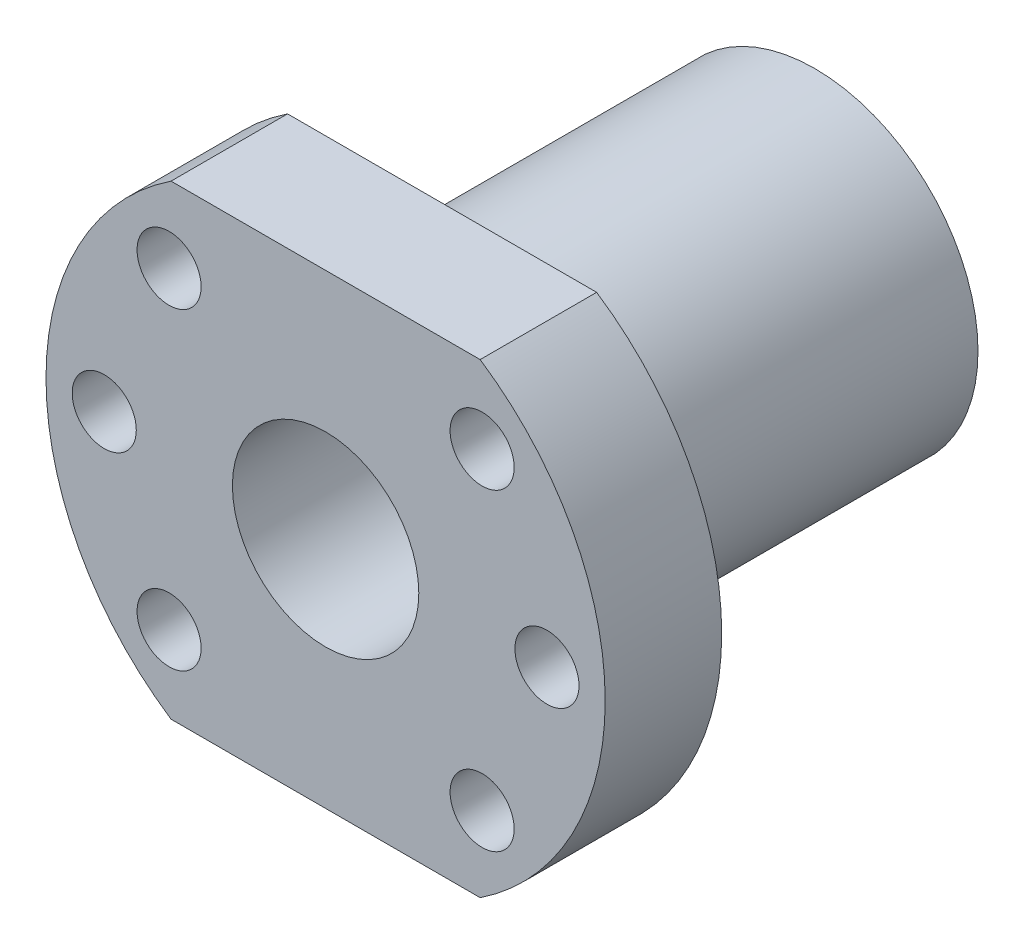
ISO-10303-21;
HEADER;
FILE_DESCRIPTION(('STEP AP214'),'2;1');
FILE_NAME('part.step','',(''),(''),'','','');
FILE_SCHEMA(('AUTOMOTIVE_DESIGN { 1 0 10303 214 1 1 1 1 }'));
ENDSEC;
DATA;
#1=APPLICATION_CONTEXT('core data for automotive mechanical design processes');
#2=APPLICATION_PROTOCOL_DEFINITION('international standard','automotive_design',2000,#1);
#3=PRODUCT_CONTEXT('',#1,'mechanical');
#4=PRODUCT('Part','Part','',(#3));
#5=PRODUCT_RELATED_PRODUCT_CATEGORY('part','',(#4));
#6=PRODUCT_DEFINITION_FORMATION('','',#4);
#7=PRODUCT_DEFINITION_CONTEXT('part definition',#1,'design');
#8=PRODUCT_DEFINITION('design','',#6,#7);
#9=PRODUCT_DEFINITION_SHAPE('','',#8);
#10=(LENGTH_UNIT() NAMED_UNIT(*) SI_UNIT(.MILLI.,.METRE.));
#11=(NAMED_UNIT(*) PLANE_ANGLE_UNIT() SI_UNIT($,.RADIAN.));
#12=(NAMED_UNIT(*) SI_UNIT($,.STERADIAN.) SOLID_ANGLE_UNIT());
#13=UNCERTAINTY_MEASURE_WITH_UNIT(LENGTH_MEASURE(1.E-05),#10,'distance_accuracy_value','');
#14=(GEOMETRIC_REPRESENTATION_CONTEXT(3) GLOBAL_UNCERTAINTY_ASSIGNED_CONTEXT((#13)) GLOBAL_UNIT_ASSIGNED_CONTEXT((#10,
#11,#12)) REPRESENTATION_CONTEXT('',''));
#15=CARTESIAN_POINT('',(0.,0.,0.));
#16=DIRECTION('',(0.,0.,1.));
#17=DIRECTION('',(1.,0.,0.));
#18=AXIS2_PLACEMENT_3D('',#15,#16,#17);
#19=CARTESIAN_POINT('',(0.,0.,-42.));
#20=DIRECTION('',(0.,0.,1.));
#21=DIRECTION('',(1.,0.,0.));
#22=AXIS2_PLACEMENT_3D('',#19,#20,#21);
#23=CYLINDRICAL_SURFACE('',#22,14.);
#24=CARTESIAN_POINT('',(0.,0.,-42.));
#25=DIRECTION('',(0.,0.,1.));
#26=DIRECTION('',(1.,0.,0.));
#27=AXIS2_PLACEMENT_3D('',#24,#25,#26);
#28=CIRCLE('',#27,14.);
#29=CARTESIAN_POINT('',(14.,0.,-42.));
#30=VERTEX_POINT('',#29);
#31=EDGE_CURVE('E11',#30,#30,#28,.T.);
#32=ORIENTED_EDGE('',*,*,#31,.T.);
#33=EDGE_LOOP('',(#32));
#34=FACE_BOUND('',#33,.T.);
#35=CARTESIAN_POINT('',(0.,0.,-10.));
#36=DIRECTION('',(0.,0.,1.));
#37=DIRECTION('',(1.,0.,0.));
#38=AXIS2_PLACEMENT_3D('',#35,#36,#37);
#39=CIRCLE('',#38,14.);
#40=CARTESIAN_POINT('',(14.,0.,-10.));
#41=VERTEX_POINT('',#40);
#42=EDGE_CURVE('E105',#41,#41,#39,.F.);
#43=ORIENTED_EDGE('',*,*,#42,.T.);
#44=EDGE_LOOP('',(#43));
#45=FACE_BOUND('',#44,.T.);
#46=ADVANCED_FACE('F34',(#34,#45),#23,.T.);
#47=CARTESIAN_POINT('',(0.,0.,-42.));
#48=DIRECTION('',(0.,0.,1.));
#49=DIRECTION('',(1.,0.,0.));
#50=AXIS2_PLACEMENT_3D('',#47,#48,#49);
#51=PLANE('',#50);
#52=CARTESIAN_POINT('',(0.,0.,-42.));
#53=DIRECTION('',(0.,0.,1.));
#54=DIRECTION('',(1.,0.,0.));
#55=AXIS2_PLACEMENT_3D('',#52,#53,#54);
#56=CIRCLE('',#55,8.);
#57=CARTESIAN_POINT('',(8.,0.,-42.));
#58=VERTEX_POINT('',#57);
#59=EDGE_CURVE('E43',#58,#58,#56,.T.);
#60=ORIENTED_EDGE('',*,*,#59,.T.);
#61=EDGE_LOOP('',(#60));
#62=FACE_BOUND('',#61,.T.);
#63=ORIENTED_EDGE('',*,*,#31,.F.);
#64=EDGE_LOOP('',(#63));
#65=FACE_BOUND('',#64,.T.);
#66=ADVANCED_FACE('F173',(#62,#65),#51,.F.);
#67=CARTESIAN_POINT('',(0.,0.,0.));
#68=DIRECTION('',(0.,0.,1.));
#69=DIRECTION('',(1.,0.,0.));
#70=AXIS2_PLACEMENT_3D('',#67,#68,#69);
#71=PLANE('',#70);
#72=CARTESIAN_POINT('',(-13.4350288425445,13.4350288425443,0.));
#73=DIRECTION('',(0.,0.,1.));
#74=DIRECTION('',(1.,0.,0.));
#75=AXIS2_PLACEMENT_3D('',#72,#73,#74);
#76=CIRCLE('',#75,2.74999999999999);
#77=CARTESIAN_POINT('',(-10.6850288425445,13.4350288425443,0.));
#78=VERTEX_POINT('',#77);
#79=EDGE_CURVE('E137',#78,#78,#76,.T.);
#80=ORIENTED_EDGE('',*,*,#79,.F.);
#81=EDGE_LOOP('',(#80));
#82=FACE_BOUND('',#81,.T.);
#83=CARTESIAN_POINT('',(13.4350288425445,-13.4350288425443,0.));
#84=DIRECTION('',(0.,0.,1.));
#85=DIRECTION('',(1.,0.,0.));
#86=AXIS2_PLACEMENT_3D('',#83,#84,#85);
#87=CIRCLE('',#86,2.74999999999999);
#88=CARTESIAN_POINT('',(16.1850288425445,-13.4350288425443,0.));
#89=VERTEX_POINT('',#88);
#90=EDGE_CURVE('E127',#89,#89,#87,.T.);
#91=ORIENTED_EDGE('',*,*,#90,.F.);
#92=EDGE_LOOP('',(#91));
#93=FACE_BOUND('',#92,.T.);
#94=CARTESIAN_POINT('',(13.4350288425444,13.4350288425444,0.));
#95=DIRECTION('',(0.,0.,1.));
#96=DIRECTION('',(1.,0.,0.));
#97=AXIS2_PLACEMENT_3D('',#94,#95,#96);
#98=CIRCLE('',#97,2.74999999999999);
#99=CARTESIAN_POINT('',(16.1850288425444,13.4350288425444,0.));
#100=VERTEX_POINT('',#99);
#101=EDGE_CURVE('E124',#100,#100,#98,.T.);
#102=ORIENTED_EDGE('',*,*,#101,.F.);
#103=EDGE_LOOP('',(#102));
#104=FACE_BOUND('',#103,.T.);
#105=CARTESIAN_POINT('',(-13.4350288425444,-13.4350288425444,0.));
#106=DIRECTION('',(0.,0.,1.));
#107=DIRECTION('',(1.,0.,0.));
#108=AXIS2_PLACEMENT_3D('',#105,#106,#107);
#109=CIRCLE('',#108,2.74999999999999);
#110=CARTESIAN_POINT('',(-10.6850288425444,-13.4350288425444,0.));
#111=VERTEX_POINT('',#110);
#112=EDGE_CURVE('E121',#111,#111,#109,.T.);
#113=ORIENTED_EDGE('',*,*,#112,.F.);
#114=EDGE_LOOP('',(#113));
#115=FACE_BOUND('',#114,.T.);
#116=CARTESIAN_POINT('',(19.,0.,0.));
#117=DIRECTION('',(0.,0.,1.));
#118=DIRECTION('',(1.,0.,0.));
#119=AXIS2_PLACEMENT_3D('',#116,#117,#118);
#120=CIRCLE('',#119,2.74999999999999);
#121=CARTESIAN_POINT('',(21.75,0.,0.));
#122=VERTEX_POINT('',#121);
#123=EDGE_CURVE('E117',#122,#122,#120,.T.);
#124=ORIENTED_EDGE('',*,*,#123,.F.);
#125=EDGE_LOOP('',(#124));
#126=FACE_BOUND('',#125,.T.);
#127=CARTESIAN_POINT('',(-19.,0.,0.));
#128=DIRECTION('',(0.,0.,1.));
#129=DIRECTION('',(1.,0.,0.));
#130=AXIS2_PLACEMENT_3D('',#127,#128,#129);
#131=CIRCLE('',#130,2.74999999999999);
#132=CARTESIAN_POINT('',(-16.25,0.,0.));
#133=VERTEX_POINT('',#132);
#134=EDGE_CURVE('E116',#133,#133,#131,.T.);
#135=ORIENTED_EDGE('',*,*,#134,.F.);
#136=EDGE_LOOP('',(#135));
#137=FACE_BOUND('',#136,.T.);
#138=CARTESIAN_POINT('',(0.,0.,0.));
#139=DIRECTION('',(0.,0.,1.));
#140=DIRECTION('',(1.,0.,0.));
#141=AXIS2_PLACEMENT_3D('',#138,#139,#140);
#142=CIRCLE('',#141,8.);
#143=CARTESIAN_POINT('',(8.,0.,0.));
#144=VERTEX_POINT('',#143);
#145=EDGE_CURVE('E108',#144,#144,#142,.T.);
#146=ORIENTED_EDGE('',*,*,#145,.F.);
#147=EDGE_LOOP('',(#146));
#148=FACE_BOUND('',#147,.T.);
#149=DIRECTION('',(1.,0.,0.));
#150=VECTOR('',#149,1.);
#151=CARTESIAN_POINT('',(0.,20.,0.));
#152=LINE('',#151,#150);
#153=CARTESIAN_POINT('',(-13.2664991614216,20.,0.));
#154=VERTEX_POINT('',#153);
#155=CARTESIAN_POINT('',(13.2664991614216,20.,0.));
#156=VERTEX_POINT('',#155);
#157=EDGE_CURVE('E148',#154,#156,#152,.T.);
#158=ORIENTED_EDGE('',*,*,#157,.F.);
#159=CARTESIAN_POINT('',(0.,0.,0.));
#160=DIRECTION('',(0.,0.,1.));
#161=DIRECTION('',(1.,0.,0.));
#162=AXIS2_PLACEMENT_3D('',#159,#160,#161);
#163=CIRCLE('',#162,24.);
#164=CARTESIAN_POINT('',(-13.2664991614216,-20.,0.));
#165=VERTEX_POINT('',#164);
#166=EDGE_CURVE('E151',#154,#165,#163,.T.);
#167=ORIENTED_EDGE('',*,*,#166,.T.);
#168=DIRECTION('',(1.,0.,0.));
#169=VECTOR('',#168,1.);
#170=CARTESIAN_POINT('',(0.,-20.,0.));
#171=LINE('',#170,#169);
#172=CARTESIAN_POINT('',(13.2664991614216,-20.,0.));
#173=VERTEX_POINT('',#172);
#174=EDGE_CURVE('E89',#165,#173,#171,.T.);
#175=ORIENTED_EDGE('',*,*,#174,.T.);
#176=EDGE_CURVE('E98',#173,#156,#163,.T.);
#177=ORIENTED_EDGE('',*,*,#176,.T.);
#178=EDGE_LOOP('',(#158,#167,#175,#177));
#179=FACE_BOUND('',#178,.T.);
#180=ADVANCED_FACE('F158',(#82,#93,#104,#115,#126,#137,#148,#179),#71,.T.);
#181=CARTESIAN_POINT('',(0.,0.,-42.));
#182=DIRECTION('',(0.,0.,1.));
#183=DIRECTION('',(1.,0.,0.));
#184=AXIS2_PLACEMENT_3D('',#181,#182,#183);
#185=CYLINDRICAL_SURFACE('',#184,8.);
#186=ORIENTED_EDGE('',*,*,#145,.T.);
#187=EDGE_LOOP('',(#186));
#188=FACE_BOUND('',#187,.T.);
#189=ORIENTED_EDGE('',*,*,#59,.F.);
#190=EDGE_LOOP('',(#189));
#191=FACE_BOUND('',#190,.T.);
#192=ADVANCED_FACE('F168',(#188,#191),#185,.F.);
#193=CARTESIAN_POINT('',(0.,20.,-10.));
#194=DIRECTION('',(0.,-1.,0.));
#195=DIRECTION('',(0.,0.,-1.));
#196=AXIS2_PLACEMENT_3D('',#193,#194,#195);
#197=PLANE('',#196);
#198=ORIENTED_EDGE('',*,*,#157,.T.);
#199=DIRECTION('',(0.,0.,1.));
#200=VECTOR('',#199,1.);
#201=CARTESIAN_POINT('',(13.2664991614216,20.,-10.));
#202=LINE('',#201,#200);
#203=CARTESIAN_POINT('',(13.2664991614216,20.,-10.));
#204=VERTEX_POINT('',#203);
#205=EDGE_CURVE('E76',#204,#156,#202,.T.);
#206=ORIENTED_EDGE('',*,*,#205,.F.);
#207=DIRECTION('',(1.,0.,0.));
#208=VECTOR('',#207,1.);
#209=CARTESIAN_POINT('',(0.,20.,-10.));
#210=LINE('',#209,#208);
#211=CARTESIAN_POINT('',(-13.2664991614216,20.,-10.));
#212=VERTEX_POINT('',#211);
#213=EDGE_CURVE('E52',#212,#204,#210,.T.);
#214=ORIENTED_EDGE('',*,*,#213,.F.);
#215=DIRECTION('',(0.,0.,1.));
#216=VECTOR('',#215,1.);
#217=CARTESIAN_POINT('',(-13.2664991614216,20.,-10.));
#218=LINE('',#217,#216);
#219=EDGE_CURVE('E83',#212,#154,#218,.T.);
#220=ORIENTED_EDGE('',*,*,#219,.T.);
#221=EDGE_LOOP('',(#198,#206,#214,#220));
#222=FACE_BOUND('',#221,.T.);
#223=ADVANCED_FACE('F161',(#222),#197,.F.);
#224=CARTESIAN_POINT('',(0.,0.,-10.));
#225=DIRECTION('',(0.,0.,1.));
#226=DIRECTION('',(1.,0.,0.));
#227=AXIS2_PLACEMENT_3D('',#224,#225,#226);
#228=CYLINDRICAL_SURFACE('',#227,24.);
#229=ORIENTED_EDGE('',*,*,#176,.F.);
#230=DIRECTION('',(0.,0.,1.));
#231=VECTOR('',#230,1.);
#232=CARTESIAN_POINT('',(13.2664991614216,-20.,-10.));
#233=LINE('',#232,#231);
#234=CARTESIAN_POINT('',(13.2664991614216,-20.,-10.));
#235=VERTEX_POINT('',#234);
#236=EDGE_CURVE('E69',#235,#173,#233,.T.);
#237=ORIENTED_EDGE('',*,*,#236,.F.);
#238=CARTESIAN_POINT('',(0.,0.,-10.));
#239=DIRECTION('',(0.,0.,1.));
#240=DIRECTION('',(1.,0.,0.));
#241=AXIS2_PLACEMENT_3D('',#238,#239,#240);
#242=CIRCLE('',#241,24.);
#243=EDGE_CURVE('E94',#235,#204,#242,.T.);
#244=ORIENTED_EDGE('',*,*,#243,.T.);
#245=ORIENTED_EDGE('',*,*,#205,.T.);
#246=EDGE_LOOP('',(#229,#237,#244,#245));
#247=FACE_BOUND('',#246,.T.);
#248=ADVANCED_FACE('F159',(#247),#228,.T.);
#249=CARTESIAN_POINT('',(0.,-20.,-10.));
#250=DIRECTION('',(0.,-1.,0.));
#251=DIRECTION('',(0.,0.,-1.));
#252=AXIS2_PLACEMENT_3D('',#249,#250,#251);
#253=PLANE('',#252);
#254=ORIENTED_EDGE('',*,*,#174,.F.);
#255=DIRECTION('',(0.,0.,1.));
#256=VECTOR('',#255,1.);
#257=CARTESIAN_POINT('',(-13.2664991614216,-20.,-10.));
#258=LINE('',#257,#256);
#259=CARTESIAN_POINT('',(-13.2664991614216,-20.,-10.));
#260=VERTEX_POINT('',#259);
#261=EDGE_CURVE('E85',#260,#165,#258,.T.);
#262=ORIENTED_EDGE('',*,*,#261,.F.);
#263=DIRECTION('',(1.,0.,0.));
#264=VECTOR('',#263,1.);
#265=CARTESIAN_POINT('',(0.,-20.,-10.));
#266=LINE('',#265,#264);
#267=EDGE_CURVE('E88',#260,#235,#266,.T.);
#268=ORIENTED_EDGE('',*,*,#267,.T.);
#269=ORIENTED_EDGE('',*,*,#236,.T.);
#270=EDGE_LOOP('',(#254,#262,#268,#269));
#271=FACE_BOUND('',#270,.T.);
#272=ADVANCED_FACE('F87',(#271),#253,.T.);
#273=ORIENTED_EDGE('',*,*,#166,.F.);
#274=ORIENTED_EDGE('',*,*,#219,.F.);
#275=EDGE_CURVE('E93',#212,#260,#242,.T.);
#276=ORIENTED_EDGE('',*,*,#275,.T.);
#277=ORIENTED_EDGE('',*,*,#261,.T.);
#278=EDGE_LOOP('',(#273,#274,#276,#277));
#279=FACE_BOUND('',#278,.T.);
#280=ADVANCED_FACE('F96',(#279),#228,.T.);
#281=CARTESIAN_POINT('',(0.,0.,-10.));
#282=DIRECTION('',(0.,0.,1.));
#283=DIRECTION('',(1.,0.,0.));
#284=AXIS2_PLACEMENT_3D('',#281,#282,#283);
#285=PLANE('',#284);
#286=CARTESIAN_POINT('',(-13.4350288425445,13.4350288425443,-10.));
#287=DIRECTION('',(0.,0.,1.));
#288=DIRECTION('',(1.,0.,0.));
#289=AXIS2_PLACEMENT_3D('',#286,#287,#288);
#290=CIRCLE('',#289,2.74999999999999);
#291=CARTESIAN_POINT('',(-10.6850288425445,13.4350288425443,-10.));
#292=VERTEX_POINT('',#291);
#293=EDGE_CURVE('E37',#292,#292,#290,.T.);
#294=ORIENTED_EDGE('',*,*,#293,.T.);
#295=EDGE_LOOP('',(#294));
#296=FACE_BOUND('',#295,.T.);
#297=CARTESIAN_POINT('',(13.4350288425445,-13.4350288425443,-10.));
#298=DIRECTION('',(0.,0.,1.));
#299=DIRECTION('',(1.,0.,0.));
#300=AXIS2_PLACEMENT_3D('',#297,#298,#299);
#301=CIRCLE('',#300,2.74999999999999);
#302=CARTESIAN_POINT('',(16.1850288425445,-13.4350288425443,-10.));
#303=VERTEX_POINT('',#302);
#304=EDGE_CURVE('E125',#303,#303,#301,.T.);
#305=ORIENTED_EDGE('',*,*,#304,.T.);
#306=EDGE_LOOP('',(#305));
#307=FACE_BOUND('',#306,.T.);
#308=CARTESIAN_POINT('',(13.4350288425444,13.4350288425444,-10.));
#309=DIRECTION('',(0.,0.,1.));
#310=DIRECTION('',(1.,0.,0.));
#311=AXIS2_PLACEMENT_3D('',#308,#309,#310);
#312=CIRCLE('',#311,2.74999999999999);
#313=CARTESIAN_POINT('',(16.1850288425444,13.4350288425444,-10.));
#314=VERTEX_POINT('',#313);
#315=EDGE_CURVE('E122',#314,#314,#312,.T.);
#316=ORIENTED_EDGE('',*,*,#315,.T.);
#317=EDGE_LOOP('',(#316));
#318=FACE_BOUND('',#317,.T.);
#319=CARTESIAN_POINT('',(-13.4350288425444,-13.4350288425444,-10.));
#320=DIRECTION('',(0.,0.,1.));
#321=DIRECTION('',(1.,0.,0.));
#322=AXIS2_PLACEMENT_3D('',#319,#320,#321);
#323=CIRCLE('',#322,2.74999999999999);
#324=CARTESIAN_POINT('',(-10.6850288425444,-13.4350288425444,-10.));
#325=VERTEX_POINT('',#324);
#326=EDGE_CURVE('E118',#325,#325,#323,.T.);
#327=ORIENTED_EDGE('',*,*,#326,.T.);
#328=EDGE_LOOP('',(#327));
#329=FACE_BOUND('',#328,.T.);
#330=CARTESIAN_POINT('',(19.,0.,-10.));
#331=DIRECTION('',(0.,0.,1.));
#332=DIRECTION('',(1.,0.,0.));
#333=AXIS2_PLACEMENT_3D('',#330,#331,#332);
#334=CIRCLE('',#333,2.74999999999999);
#335=CARTESIAN_POINT('',(21.75,0.,-10.));
#336=VERTEX_POINT('',#335);
#337=EDGE_CURVE('E113',#336,#336,#334,.T.);
#338=ORIENTED_EDGE('',*,*,#337,.T.);
#339=EDGE_LOOP('',(#338));
#340=FACE_BOUND('',#339,.T.);
#341=CARTESIAN_POINT('',(-19.,0.,-10.));
#342=DIRECTION('',(0.,0.,1.));
#343=DIRECTION('',(1.,0.,0.));
#344=AXIS2_PLACEMENT_3D('',#341,#342,#343);
#345=CIRCLE('',#344,2.74999999999999);
#346=CARTESIAN_POINT('',(-16.25,0.,-10.));
#347=VERTEX_POINT('',#346);
#348=EDGE_CURVE('E146',#347,#347,#345,.T.);
#349=ORIENTED_EDGE('',*,*,#348,.T.);
#350=EDGE_LOOP('',(#349));
#351=FACE_BOUND('',#350,.T.);
#352=ORIENTED_EDGE('',*,*,#42,.F.);
#353=EDGE_LOOP('',(#352));
#354=FACE_BOUND('',#353,.T.);
#355=ORIENTED_EDGE('',*,*,#213,.T.);
#356=ORIENTED_EDGE('',*,*,#243,.F.);
#357=ORIENTED_EDGE('',*,*,#267,.F.);
#358=ORIENTED_EDGE('',*,*,#275,.F.);
#359=EDGE_LOOP('',(#355,#356,#357,#358));
#360=FACE_BOUND('',#359,.T.);
#361=ADVANCED_FACE('F92',(#296,#307,#318,#329,#340,#351,#354,#360),#285,.F.);
#362=CARTESIAN_POINT('',(-19.,0.,0.));
#363=DIRECTION('',(0.,0.,1.));
#364=DIRECTION('',(1.,0.,0.));
#365=AXIS2_PLACEMENT_3D('',#362,#363,#364);
#366=CYLINDRICAL_SURFACE('',#365,2.74999999999999);
#367=ORIENTED_EDGE('',*,*,#134,.T.);
#368=EDGE_LOOP('',(#367));
#369=FACE_BOUND('',#368,.T.);
#370=ORIENTED_EDGE('',*,*,#348,.F.);
#371=EDGE_LOOP('',(#370));
#372=FACE_BOUND('',#371,.T.);
#373=ADVANCED_FACE('F185',(#369,#372),#366,.F.);
#374=CARTESIAN_POINT('',(19.,0.,0.));
#375=DIRECTION('',(0.,0.,1.));
#376=DIRECTION('',(1.,0.,0.));
#377=AXIS2_PLACEMENT_3D('',#374,#375,#376);
#378=CYLINDRICAL_SURFACE('',#377,2.74999999999999);
#379=ORIENTED_EDGE('',*,*,#123,.T.);
#380=EDGE_LOOP('',(#379));
#381=FACE_BOUND('',#380,.T.);
#382=ORIENTED_EDGE('',*,*,#337,.F.);
#383=EDGE_LOOP('',(#382));
#384=FACE_BOUND('',#383,.T.);
#385=ADVANCED_FACE('F190',(#381,#384),#378,.F.);
#386=CARTESIAN_POINT('',(-13.4350288425444,-13.4350288425444,0.));
#387=DIRECTION('',(0.,0.,1.));
#388=DIRECTION('',(1.,0.,0.));
#389=AXIS2_PLACEMENT_3D('',#386,#387,#388);
#390=CYLINDRICAL_SURFACE('',#389,2.74999999999999);
#391=ORIENTED_EDGE('',*,*,#112,.T.);
#392=EDGE_LOOP('',(#391));
#393=FACE_BOUND('',#392,.T.);
#394=ORIENTED_EDGE('',*,*,#326,.F.);
#395=EDGE_LOOP('',(#394));
#396=FACE_BOUND('',#395,.T.);
#397=ADVANCED_FACE('F196',(#393,#396),#390,.F.);
#398=CARTESIAN_POINT('',(13.4350288425444,13.4350288425444,0.));
#399=DIRECTION('',(0.,0.,1.));
#400=DIRECTION('',(1.,0.,0.));
#401=AXIS2_PLACEMENT_3D('',#398,#399,#400);
#402=CYLINDRICAL_SURFACE('',#401,2.74999999999999);
#403=ORIENTED_EDGE('',*,*,#101,.T.);
#404=EDGE_LOOP('',(#403));
#405=FACE_BOUND('',#404,.T.);
#406=ORIENTED_EDGE('',*,*,#315,.F.);
#407=EDGE_LOOP('',(#406));
#408=FACE_BOUND('',#407,.T.);
#409=ADVANCED_FACE('F200',(#405,#408),#402,.F.);
#410=CARTESIAN_POINT('',(13.4350288425445,-13.4350288425443,0.));
#411=DIRECTION('',(0.,0.,1.));
#412=DIRECTION('',(1.,0.,0.));
#413=AXIS2_PLACEMENT_3D('',#410,#411,#412);
#414=CYLINDRICAL_SURFACE('',#413,2.74999999999999);
#415=ORIENTED_EDGE('',*,*,#90,.T.);
#416=EDGE_LOOP('',(#415));
#417=FACE_BOUND('',#416,.T.);
#418=ORIENTED_EDGE('',*,*,#304,.F.);
#419=EDGE_LOOP('',(#418));
#420=FACE_BOUND('',#419,.T.);
#421=ADVANCED_FACE('F204',(#417,#420),#414,.F.);
#422=CARTESIAN_POINT('',(-13.4350288425445,13.4350288425443,0.));
#423=DIRECTION('',(0.,0.,1.));
#424=DIRECTION('',(1.,0.,0.));
#425=AXIS2_PLACEMENT_3D('',#422,#423,#424);
#426=CYLINDRICAL_SURFACE('',#425,2.74999999999999);
#427=ORIENTED_EDGE('',*,*,#79,.T.);
#428=EDGE_LOOP('',(#427));
#429=FACE_BOUND('',#428,.T.);
#430=ORIENTED_EDGE('',*,*,#293,.F.);
#431=EDGE_LOOP('',(#430));
#432=FACE_BOUND('',#431,.T.);
#433=ADVANCED_FACE('F208',(#429,#432),#426,.F.);
#434=CLOSED_SHELL('',(#46,#66,#180,#192,#223,#248,#272,#280,#361,#373,#385,#397,#409,#421,#433));
#435=MANIFOLD_SOLID_BREP('B2',#434);
#436=ADVANCED_BREP_SHAPE_REPRESENTATION('',(#18,#435),#14);
#437=SHAPE_DEFINITION_REPRESENTATION(#9,#436);
ENDSEC;
END-ISO-10303-21;
